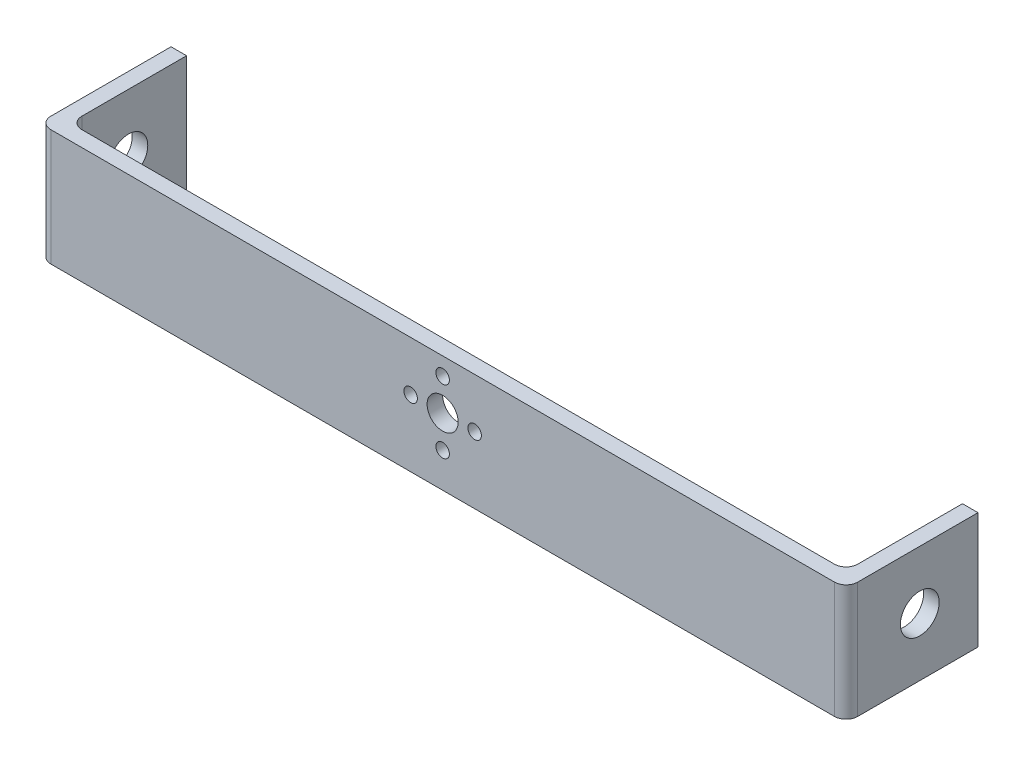
ISO-10303-21;
HEADER;
FILE_DESCRIPTION(('STEP AP214'),'2;1');
FILE_NAME('part.step','',(''),(''),'','','');
FILE_SCHEMA(('AUTOMOTIVE_DESIGN { 1 0 10303 214 1 1 1 1 }'));
ENDSEC;
DATA;
#1=APPLICATION_CONTEXT('core data for automotive mechanical design processes');
#2=APPLICATION_PROTOCOL_DEFINITION('international standard','automotive_design',2000,#1);
#3=PRODUCT_CONTEXT('',#1,'mechanical');
#4=PRODUCT('Part','Part','',(#3));
#5=PRODUCT_RELATED_PRODUCT_CATEGORY('part','',(#4));
#6=PRODUCT_DEFINITION_FORMATION('','',#4);
#7=PRODUCT_DEFINITION_CONTEXT('part definition',#1,'design');
#8=PRODUCT_DEFINITION('design','',#6,#7);
#9=PRODUCT_DEFINITION_SHAPE('','',#8);
#10=(LENGTH_UNIT() NAMED_UNIT(*) SI_UNIT(.MILLI.,.METRE.));
#11=(NAMED_UNIT(*) PLANE_ANGLE_UNIT() SI_UNIT($,.RADIAN.));
#12=(NAMED_UNIT(*) SI_UNIT($,.STERADIAN.) SOLID_ANGLE_UNIT());
#13=UNCERTAINTY_MEASURE_WITH_UNIT(LENGTH_MEASURE(1.E-05),#10,'distance_accuracy_value','');
#14=(GEOMETRIC_REPRESENTATION_CONTEXT(3) GLOBAL_UNCERTAINTY_ASSIGNED_CONTEXT((#13)) GLOBAL_UNIT_ASSIGNED_CONTEXT((#10,
#11,#12)) REPRESENTATION_CONTEXT('',''));
#15=CARTESIAN_POINT('',(0.,0.,0.));
#16=DIRECTION('',(0.,0.,1.));
#17=DIRECTION('',(1.,0.,0.));
#18=AXIS2_PLACEMENT_3D('',#15,#16,#17);
#19=CARTESIAN_POINT('',(100.,0.,0.));
#20=DIRECTION('',(0.,-1.,0.));
#21=DIRECTION('',(0.,0.,-1.));
#22=AXIS2_PLACEMENT_3D('',#19,#20,#21);
#23=PLANE('',#22);
#24=DIRECTION('',(1.,0.,0.));
#25=VECTOR('',#24,1.);
#26=CARTESIAN_POINT('',(-100.,0.,4.));
#27=LINE('',#26,#25);
#28=CARTESIAN_POINT('',(-101.,0.,4.));
#29=VERTEX_POINT('',#28);
#30=CARTESIAN_POINT('',(101.,0.,4.));
#31=VERTEX_POINT('',#30);
#32=EDGE_CURVE('E149',#29,#31,#27,.T.);
#33=ORIENTED_EDGE('',*,*,#32,.F.);
#34=CARTESIAN_POINT('',(-101.,0.,1.));
#35=DIRECTION('',(0.,-1.,0.));
#36=DIRECTION('',(0.,0.,-1.));
#37=AXIS2_PLACEMENT_3D('',#34,#35,#36);
#38=CIRCLE('',#37,3.);
#39=CARTESIAN_POINT('',(-104.,0.,1.));
#40=VERTEX_POINT('',#39);
#41=EDGE_CURVE('E199',#29,#40,#38,.T.);
#42=ORIENTED_EDGE('',*,*,#41,.T.);
#43=DIRECTION('',(0.,0.,1.));
#44=VECTOR('',#43,1.);
#45=CARTESIAN_POINT('',(-104.,0.,0.));
#46=LINE('',#45,#44);
#47=CARTESIAN_POINT('',(-104.,0.,-30.));
#48=VERTEX_POINT('',#47);
#49=EDGE_CURVE('E156',#48,#40,#46,.T.);
#50=ORIENTED_EDGE('',*,*,#49,.F.);
#51=DIRECTION('',(-1.,0.,0.));
#52=VECTOR('',#51,1.);
#53=CARTESIAN_POINT('',(-100.,0.,-30.));
#54=LINE('',#53,#52);
#55=CARTESIAN_POINT('',(-100.,0.,-30.));
#56=VERTEX_POINT('',#55);
#57=EDGE_CURVE('E183',#56,#48,#54,.T.);
#58=ORIENTED_EDGE('',*,*,#57,.F.);
#59=DIRECTION('',(0.,0.,1.));
#60=VECTOR('',#59,1.);
#61=CARTESIAN_POINT('',(-100.,0.,0.));
#62=LINE('',#61,#60);
#63=CARTESIAN_POINT('',(-100.,0.,-3.));
#64=VERTEX_POINT('',#63);
#65=EDGE_CURVE('E132',#56,#64,#62,.T.);
#66=ORIENTED_EDGE('',*,*,#65,.T.);
#67=CARTESIAN_POINT('',(-97.,0.,-3.));
#68=DIRECTION('',(0.,-1.,0.));
#69=DIRECTION('',(0.,0.,-1.));
#70=AXIS2_PLACEMENT_3D('',#67,#68,#69);
#71=CIRCLE('',#70,3.);
#72=CARTESIAN_POINT('',(-97.,0.,0.));
#73=VERTEX_POINT('',#72);
#74=EDGE_CURVE('E215',#64,#73,#71,.F.);
#75=ORIENTED_EDGE('',*,*,#74,.T.);
#76=DIRECTION('',(1.,0.,0.));
#77=VECTOR('',#76,1.);
#78=CARTESIAN_POINT('',(-100.,0.,0.));
#79=LINE('',#78,#77);
#80=CARTESIAN_POINT('',(97.,0.,0.));
#81=VERTEX_POINT('',#80);
#82=EDGE_CURVE('E162',#73,#81,#79,.T.);
#83=ORIENTED_EDGE('',*,*,#82,.T.);
#84=CARTESIAN_POINT('',(97.,0.,-3.));
#85=DIRECTION('',(0.,-1.,0.));
#86=DIRECTION('',(0.,0.,-1.));
#87=AXIS2_PLACEMENT_3D('',#84,#85,#86);
#88=CIRCLE('',#87,3.);
#89=CARTESIAN_POINT('',(100.,0.,-3.));
#90=VERTEX_POINT('',#89);
#91=EDGE_CURVE('E11',#81,#90,#88,.F.);
#92=ORIENTED_EDGE('',*,*,#91,.T.);
#93=DIRECTION('',(0.,0.,-1.));
#94=VECTOR('',#93,1.);
#95=CARTESIAN_POINT('',(100.,0.,0.));
#96=LINE('',#95,#94);
#97=CARTESIAN_POINT('',(100.,0.,-30.));
#98=VERTEX_POINT('',#97);
#99=EDGE_CURVE('E167',#90,#98,#96,.T.);
#100=ORIENTED_EDGE('',*,*,#99,.T.);
#101=DIRECTION('',(1.,0.,0.));
#102=VECTOR('',#101,1.);
#103=CARTESIAN_POINT('',(100.,0.,-30.));
#104=LINE('',#103,#102);
#105=CARTESIAN_POINT('',(104.,0.,-30.));
#106=VERTEX_POINT('',#105);
#107=EDGE_CURVE('E141',#98,#106,#104,.T.);
#108=ORIENTED_EDGE('',*,*,#107,.T.);
#109=DIRECTION('',(0.,0.,-1.));
#110=VECTOR('',#109,1.);
#111=CARTESIAN_POINT('',(104.,0.,0.));
#112=LINE('',#111,#110);
#113=CARTESIAN_POINT('',(104.,0.,1.));
#114=VERTEX_POINT('',#113);
#115=EDGE_CURVE('E131',#114,#106,#112,.T.);
#116=ORIENTED_EDGE('',*,*,#115,.F.);
#117=CARTESIAN_POINT('',(101.,0.,1.));
#118=DIRECTION('',(0.,-1.,0.));
#119=DIRECTION('',(0.,0.,-1.));
#120=AXIS2_PLACEMENT_3D('',#117,#118,#119);
#121=CIRCLE('',#120,3.);
#122=EDGE_CURVE('E197',#114,#31,#121,.T.);
#123=ORIENTED_EDGE('',*,*,#122,.T.);
#124=EDGE_LOOP('',(#33,#42,#50,#58,#66,#75,#83,#92,#100,#108,#116,#123));
#125=FACE_BOUND('',#124,.T.);
#126=ADVANCED_FACE('F34',(#125),#23,.T.);
#127=CARTESIAN_POINT('',(100.,0.,-30.));
#128=DIRECTION('',(0.,0.,-1.));
#129=DIRECTION('',(0.,1.,0.));
#130=AXIS2_PLACEMENT_3D('',#127,#128,#129);
#131=PLANE('',#130);
#132=ORIENTED_EDGE('',*,*,#107,.F.);
#133=DIRECTION('',(0.,1.,0.));
#134=VECTOR('',#133,1.);
#135=CARTESIAN_POINT('',(100.,0.,-30.));
#136=LINE('',#135,#134);
#137=CARTESIAN_POINT('',(100.,30.,-30.));
#138=VERTEX_POINT('',#137);
#139=EDGE_CURVE('E140',#98,#138,#136,.T.);
#140=ORIENTED_EDGE('',*,*,#139,.T.);
#141=DIRECTION('',(1.,0.,0.));
#142=VECTOR('',#141,1.);
#143=CARTESIAN_POINT('',(100.,30.,-30.));
#144=LINE('',#143,#142);
#145=CARTESIAN_POINT('',(104.,30.,-30.));
#146=VERTEX_POINT('',#145);
#147=EDGE_CURVE('E126',#138,#146,#144,.T.);
#148=ORIENTED_EDGE('',*,*,#147,.T.);
#149=DIRECTION('',(0.,1.,0.));
#150=VECTOR('',#149,1.);
#151=CARTESIAN_POINT('',(104.,0.,-30.));
#152=LINE('',#151,#150);
#153=EDGE_CURVE('E138',#106,#146,#152,.T.);
#154=ORIENTED_EDGE('',*,*,#153,.F.);
#155=EDGE_LOOP('',(#132,#140,#148,#154));
#156=FACE_BOUND('',#155,.T.);
#157=ADVANCED_FACE('F137',(#156),#131,.T.);
#158=CARTESIAN_POINT('',(-100.,30.,0.));
#159=DIRECTION('',(0.,-1.,0.));
#160=DIRECTION('',(0.,0.,1.));
#161=AXIS2_PLACEMENT_3D('',#158,#159,#160);
#162=PLANE('',#161);
#163=DIRECTION('',(0.,0.,1.));
#164=VECTOR('',#163,1.);
#165=CARTESIAN_POINT('',(-104.,30.,0.));
#166=LINE('',#165,#164);
#167=CARTESIAN_POINT('',(-104.,30.,-30.));
#168=VERTEX_POINT('',#167);
#169=CARTESIAN_POINT('',(-104.,30.,1.));
#170=VERTEX_POINT('',#169);
#171=EDGE_CURVE('E155',#168,#170,#166,.T.);
#172=ORIENTED_EDGE('',*,*,#171,.T.);
#173=CARTESIAN_POINT('',(-101.,30.,1.));
#174=DIRECTION('',(0.,-1.,0.));
#175=DIRECTION('',(0.,0.,-1.));
#176=AXIS2_PLACEMENT_3D('',#173,#174,#175);
#177=CIRCLE('',#176,3.);
#178=CARTESIAN_POINT('',(-101.,30.,4.));
#179=VERTEX_POINT('',#178);
#180=EDGE_CURVE('E189',#170,#179,#177,.F.);
#181=ORIENTED_EDGE('',*,*,#180,.T.);
#182=DIRECTION('',(1.,0.,0.));
#183=VECTOR('',#182,1.);
#184=CARTESIAN_POINT('',(-100.,30.,4.));
#185=LINE('',#184,#183);
#186=CARTESIAN_POINT('',(101.,30.,4.));
#187=VERTEX_POINT('',#186);
#188=EDGE_CURVE('E147',#179,#187,#185,.T.);
#189=ORIENTED_EDGE('',*,*,#188,.T.);
#190=CARTESIAN_POINT('',(101.,30.,1.));
#191=DIRECTION('',(0.,-1.,0.));
#192=DIRECTION('',(0.,0.,-1.));
#193=AXIS2_PLACEMENT_3D('',#190,#191,#192);
#194=CIRCLE('',#193,3.);
#195=CARTESIAN_POINT('',(104.,30.,1.));
#196=VERTEX_POINT('',#195);
#197=EDGE_CURVE('E50',#187,#196,#194,.F.);
#198=ORIENTED_EDGE('',*,*,#197,.T.);
#199=DIRECTION('',(0.,0.,-1.));
#200=VECTOR('',#199,1.);
#201=CARTESIAN_POINT('',(104.,30.,0.));
#202=LINE('',#201,#200);
#203=EDGE_CURVE('E121',#196,#146,#202,.T.);
#204=ORIENTED_EDGE('',*,*,#203,.T.);
#205=ORIENTED_EDGE('',*,*,#147,.F.);
#206=DIRECTION('',(0.,0.,-1.));
#207=VECTOR('',#206,1.);
#208=CARTESIAN_POINT('',(100.,30.,0.));
#209=LINE('',#208,#207);
#210=CARTESIAN_POINT('',(100.,30.,-3.));
#211=VERTEX_POINT('',#210);
#212=EDGE_CURVE('E169',#211,#138,#209,.T.);
#213=ORIENTED_EDGE('',*,*,#212,.F.);
#214=CARTESIAN_POINT('',(97.,30.,-3.));
#215=DIRECTION('',(0.,-1.,0.));
#216=DIRECTION('',(0.,0.,-1.));
#217=AXIS2_PLACEMENT_3D('',#214,#215,#216);
#218=CIRCLE('',#217,3.);
#219=CARTESIAN_POINT('',(97.,30.,0.));
#220=VERTEX_POINT('',#219);
#221=EDGE_CURVE('E43',#211,#220,#218,.T.);
#222=ORIENTED_EDGE('',*,*,#221,.T.);
#223=DIRECTION('',(1.,0.,0.));
#224=VECTOR('',#223,1.);
#225=CARTESIAN_POINT('',(-100.,30.,0.));
#226=LINE('',#225,#224);
#227=CARTESIAN_POINT('',(-97.,30.,0.));
#228=VERTEX_POINT('',#227);
#229=EDGE_CURVE('E166',#228,#220,#226,.T.);
#230=ORIENTED_EDGE('',*,*,#229,.F.);
#231=CARTESIAN_POINT('',(-97.,30.,-3.));
#232=DIRECTION('',(0.,-1.,0.));
#233=DIRECTION('',(0.,0.,-1.));
#234=AXIS2_PLACEMENT_3D('',#231,#232,#233);
#235=CIRCLE('',#234,3.);
#236=CARTESIAN_POINT('',(-100.,30.,-3.));
#237=VERTEX_POINT('',#236);
#238=EDGE_CURVE('E213',#228,#237,#235,.T.);
#239=ORIENTED_EDGE('',*,*,#238,.T.);
#240=DIRECTION('',(0.,0.,1.));
#241=VECTOR('',#240,1.);
#242=CARTESIAN_POINT('',(-100.,30.,0.));
#243=LINE('',#242,#241);
#244=CARTESIAN_POINT('',(-100.,30.,-30.));
#245=VERTEX_POINT('',#244);
#246=EDGE_CURVE('E165',#245,#237,#243,.T.);
#247=ORIENTED_EDGE('',*,*,#246,.F.);
#248=DIRECTION('',(-1.,0.,0.));
#249=VECTOR('',#248,1.);
#250=CARTESIAN_POINT('',(-100.,30.,-30.));
#251=LINE('',#250,#249);
#252=EDGE_CURVE('E142',#245,#168,#251,.T.);
#253=ORIENTED_EDGE('',*,*,#252,.T.);
#254=EDGE_LOOP('',(#172,#181,#189,#198,#204,#205,#213,#222,#230,#239,#247,#253));
#255=FACE_BOUND('',#254,.T.);
#256=ADVANCED_FACE('F124',(#255),#162,.F.);
#257=CARTESIAN_POINT('',(-100.,0.,-30.));
#258=DIRECTION('',(0.,0.,1.));
#259=DIRECTION('',(0.,1.,0.));
#260=AXIS2_PLACEMENT_3D('',#257,#258,#259);
#261=PLANE('',#260);
#262=DIRECTION('',(0.,1.,0.));
#263=VECTOR('',#262,1.);
#264=CARTESIAN_POINT('',(-100.,0.,-30.));
#265=LINE('',#264,#263);
#266=EDGE_CURVE('E172',#56,#245,#265,.T.);
#267=ORIENTED_EDGE('',*,*,#266,.F.);
#268=ORIENTED_EDGE('',*,*,#57,.T.);
#269=DIRECTION('',(0.,1.,0.));
#270=VECTOR('',#269,1.);
#271=CARTESIAN_POINT('',(-104.,0.,-30.));
#272=LINE('',#271,#270);
#273=EDGE_CURVE('E159',#48,#168,#272,.T.);
#274=ORIENTED_EDGE('',*,*,#273,.T.);
#275=ORIENTED_EDGE('',*,*,#252,.F.);
#276=EDGE_LOOP('',(#267,#268,#274,#275));
#277=FACE_BOUND('',#276,.T.);
#278=ADVANCED_FACE('F254',(#277),#261,.F.);
#279=CARTESIAN_POINT('',(-104.,0.,0.));
#280=DIRECTION('',(-1.,0.,0.));
#281=DIRECTION('',(0.,0.,1.));
#282=AXIS2_PLACEMENT_3D('',#279,#280,#281);
#283=PLANE('',#282);
#284=CARTESIAN_POINT('',(-104.,15.,-14.9968314858325));
#285=DIRECTION('',(1.,0.,0.));
#286=DIRECTION('',(0.,0.,-1.));
#287=AXIS2_PLACEMENT_3D('',#284,#285,#286);
#288=CIRCLE('',#287,5.);
#289=CARTESIAN_POINT('',(-104.,15.,-19.9968314858325));
#290=VERTEX_POINT('',#289);
#291=EDGE_CURVE('E465',#290,#290,#288,.T.);
#292=ORIENTED_EDGE('',*,*,#291,.T.);
#293=EDGE_LOOP('',(#292));
#294=FACE_BOUND('',#293,.T.);
#295=ORIENTED_EDGE('',*,*,#49,.T.);
#296=DIRECTION('',(0.,1.,0.));
#297=VECTOR('',#296,1.);
#298=CARTESIAN_POINT('',(-104.,0.,1.));
#299=LINE('',#298,#297);
#300=EDGE_CURVE('E185',#40,#170,#299,.T.);
#301=ORIENTED_EDGE('',*,*,#300,.T.);
#302=ORIENTED_EDGE('',*,*,#171,.F.);
#303=ORIENTED_EDGE('',*,*,#273,.F.);
#304=EDGE_LOOP('',(#295,#301,#302,#303));
#305=FACE_BOUND('',#304,.T.);
#306=ADVANCED_FACE('F256',(#294,#305),#283,.T.);
#307=CARTESIAN_POINT('',(-100.,0.,4.));
#308=DIRECTION('',(0.,0.,1.));
#309=DIRECTION('',(1.,0.,0.));
#310=AXIS2_PLACEMENT_3D('',#307,#308,#309);
#311=PLANE('',#310);
#312=ORIENTED_EDGE('',*,*,#188,.F.);
#313=DIRECTION('',(0.,1.,0.));
#314=VECTOR('',#313,1.);
#315=CARTESIAN_POINT('',(-101.,0.,4.));
#316=LINE('',#315,#314);
#317=EDGE_CURVE('E195',#179,#29,#316,.F.);
#318=ORIENTED_EDGE('',*,*,#317,.T.);
#319=ORIENTED_EDGE('',*,*,#32,.T.);
#320=DIRECTION('',(0.,1.,0.));
#321=VECTOR('',#320,1.);
#322=CARTESIAN_POINT('',(101.,0.,4.));
#323=LINE('',#322,#321);
#324=EDGE_CURVE('E192',#31,#187,#323,.T.);
#325=ORIENTED_EDGE('',*,*,#324,.T.);
#326=EDGE_LOOP('',(#312,#318,#319,#325));
#327=FACE_BOUND('',#326,.T.);
#328=CARTESIAN_POINT('',(8.25,17.2,4.));
#329=DIRECTION('',(0.,0.,1.));
#330=DIRECTION('',(1.,0.,0.));
#331=AXIS2_PLACEMENT_3D('',#328,#329,#330);
#332=CIRCLE('',#331,1.75);
#333=CARTESIAN_POINT('',(10.,17.2,4.));
#334=VERTEX_POINT('',#333);
#335=EDGE_CURVE('E490',#334,#334,#332,.T.);
#336=ORIENTED_EDGE('',*,*,#335,.F.);
#337=EDGE_LOOP('',(#336));
#338=FACE_BOUND('',#337,.T.);
#339=CARTESIAN_POINT('',(0.,8.95,4.));
#340=DIRECTION('',(0.,0.,1.));
#341=DIRECTION('',(1.,0.,0.));
#342=AXIS2_PLACEMENT_3D('',#339,#340,#341);
#343=CIRCLE('',#342,1.75);
#344=CARTESIAN_POINT('',(1.75,8.95,4.));
#345=VERTEX_POINT('',#344);
#346=EDGE_CURVE('E493',#345,#345,#343,.T.);
#347=ORIENTED_EDGE('',*,*,#346,.F.);
#348=EDGE_LOOP('',(#347));
#349=FACE_BOUND('',#348,.T.);
#350=CARTESIAN_POINT('',(-8.25,17.2000000000001,4.));
#351=DIRECTION('',(0.,0.,1.));
#352=DIRECTION('',(1.,0.,0.));
#353=AXIS2_PLACEMENT_3D('',#350,#351,#352);
#354=CIRCLE('',#353,1.75);
#355=CARTESIAN_POINT('',(-6.5,17.2000000000001,4.));
#356=VERTEX_POINT('',#355);
#357=EDGE_CURVE('E496',#356,#356,#354,.T.);
#358=ORIENTED_EDGE('',*,*,#357,.F.);
#359=EDGE_LOOP('',(#358));
#360=FACE_BOUND('',#359,.T.);
#361=CARTESIAN_POINT('',(0.,25.45,4.));
#362=DIRECTION('',(0.,0.,1.));
#363=DIRECTION('',(1.,0.,0.));
#364=AXIS2_PLACEMENT_3D('',#361,#362,#363);
#365=CIRCLE('',#364,1.75);
#366=CARTESIAN_POINT('',(1.75,25.45,4.));
#367=VERTEX_POINT('',#366);
#368=EDGE_CURVE('E484',#367,#367,#365,.T.);
#369=ORIENTED_EDGE('',*,*,#368,.F.);
#370=EDGE_LOOP('',(#369));
#371=FACE_BOUND('',#370,.T.);
#372=CARTESIAN_POINT('',(0.,17.2,4.));
#373=DIRECTION('',(0.,0.,1.));
#374=DIRECTION('',(1.,0.,0.));
#375=AXIS2_PLACEMENT_3D('',#372,#373,#374);
#376=CIRCLE('',#375,4.);
#377=CARTESIAN_POINT('',(4.,17.2,4.));
#378=VERTEX_POINT('',#377);
#379=EDGE_CURVE('E466',#378,#378,#376,.T.);
#380=ORIENTED_EDGE('',*,*,#379,.F.);
#381=EDGE_LOOP('',(#380));
#382=FACE_BOUND('',#381,.T.);
#383=ADVANCED_FACE('F277',(#327,#338,#349,#360,#371,#382),#311,.T.);
#384=CARTESIAN_POINT('',(104.,0.,0.));
#385=DIRECTION('',(1.,0.,0.));
#386=DIRECTION('',(0.,0.,-1.));
#387=AXIS2_PLACEMENT_3D('',#384,#385,#386);
#388=PLANE('',#387);
#389=CARTESIAN_POINT('',(104.,15.,-14.9968314858325));
#390=DIRECTION('',(1.,0.,0.));
#391=DIRECTION('',(0.,0.,-1.));
#392=AXIS2_PLACEMENT_3D('',#389,#390,#391);
#393=CIRCLE('',#392,5.);
#394=CARTESIAN_POINT('',(104.,15.,-19.9968314858325));
#395=VERTEX_POINT('',#394);
#396=EDGE_CURVE('E176',#395,#395,#393,.T.);
#397=ORIENTED_EDGE('',*,*,#396,.F.);
#398=EDGE_LOOP('',(#397));
#399=FACE_BOUND('',#398,.T.);
#400=ORIENTED_EDGE('',*,*,#203,.F.);
#401=DIRECTION('',(0.,1.,0.));
#402=VECTOR('',#401,1.);
#403=CARTESIAN_POINT('',(104.,0.,1.));
#404=LINE('',#403,#402);
#405=EDGE_CURVE('E211',#196,#114,#404,.F.);
#406=ORIENTED_EDGE('',*,*,#405,.T.);
#407=ORIENTED_EDGE('',*,*,#115,.T.);
#408=ORIENTED_EDGE('',*,*,#153,.T.);
#409=EDGE_LOOP('',(#400,#406,#407,#408));
#410=FACE_BOUND('',#409,.T.);
#411=ADVANCED_FACE('F144',(#399,#410),#388,.T.);
#412=CARTESIAN_POINT('',(-100.,0.,0.));
#413=DIRECTION('',(-1.,0.,0.));
#414=DIRECTION('',(0.,0.,1.));
#415=AXIS2_PLACEMENT_3D('',#412,#413,#414);
#416=PLANE('',#415);
#417=CARTESIAN_POINT('',(-100.,15.,-14.9968314858325));
#418=DIRECTION('',(-1.,0.,0.));
#419=DIRECTION('',(0.,0.,1.));
#420=AXIS2_PLACEMENT_3D('',#417,#418,#419);
#421=CIRCLE('',#420,5.);
#422=CARTESIAN_POINT('',(-100.,15.,-9.99683148583255));
#423=VERTEX_POINT('',#422);
#424=EDGE_CURVE('E468',#423,#423,#421,.T.);
#425=ORIENTED_EDGE('',*,*,#424,.T.);
#426=EDGE_LOOP('',(#425));
#427=FACE_BOUND('',#426,.T.);
#428=ORIENTED_EDGE('',*,*,#246,.T.);
#429=DIRECTION('',(0.,1.,0.));
#430=VECTOR('',#429,1.);
#431=CARTESIAN_POINT('',(-100.,0.,-3.));
#432=LINE('',#431,#430);
#433=EDGE_CURVE('E206',#237,#64,#432,.F.);
#434=ORIENTED_EDGE('',*,*,#433,.T.);
#435=ORIENTED_EDGE('',*,*,#65,.F.);
#436=ORIENTED_EDGE('',*,*,#266,.T.);
#437=EDGE_LOOP('',(#428,#434,#435,#436));
#438=FACE_BOUND('',#437,.T.);
#439=ADVANCED_FACE('F241',(#427,#438),#416,.F.);
#440=CARTESIAN_POINT('',(-100.,0.,0.));
#441=DIRECTION('',(0.,0.,1.));
#442=DIRECTION('',(1.,0.,0.));
#443=AXIS2_PLACEMENT_3D('',#440,#441,#442);
#444=PLANE('',#443);
#445=CARTESIAN_POINT('',(8.25,17.2,0.));
#446=DIRECTION('',(0.,0.,-1.));
#447=DIRECTION('',(0.,1.,0.));
#448=AXIS2_PLACEMENT_3D('',#445,#446,#447);
#449=CIRCLE('',#448,1.75);
#450=CARTESIAN_POINT('',(8.25000000000001,18.95,0.));
#451=VERTEX_POINT('',#450);
#452=EDGE_CURVE('E499',#451,#451,#449,.T.);
#453=ORIENTED_EDGE('',*,*,#452,.F.);
#454=EDGE_LOOP('',(#453));
#455=FACE_BOUND('',#454,.T.);
#456=CARTESIAN_POINT('',(0.,8.95,0.));
#457=DIRECTION('',(0.,0.,-1.));
#458=DIRECTION('',(1.,0.,0.));
#459=AXIS2_PLACEMENT_3D('',#456,#457,#458);
#460=CIRCLE('',#459,1.75);
#461=CARTESIAN_POINT('',(1.75,8.95,0.));
#462=VERTEX_POINT('',#461);
#463=EDGE_CURVE('E503',#462,#462,#460,.T.);
#464=ORIENTED_EDGE('',*,*,#463,.F.);
#465=EDGE_LOOP('',(#464));
#466=FACE_BOUND('',#465,.T.);
#467=CARTESIAN_POINT('',(-8.25,17.2000000000001,0.));
#468=DIRECTION('',(0.,0.,-1.));
#469=DIRECTION('',(0.,-1.,0.));
#470=AXIS2_PLACEMENT_3D('',#467,#468,#469);
#471=CIRCLE('',#470,1.75);
#472=CARTESIAN_POINT('',(-8.25000000000002,15.4500000000001,0.));
#473=VERTEX_POINT('',#472);
#474=EDGE_CURVE('E500',#473,#473,#471,.T.);
#475=ORIENTED_EDGE('',*,*,#474,.F.);
#476=EDGE_LOOP('',(#475));
#477=FACE_BOUND('',#476,.T.);
#478=CARTESIAN_POINT('',(0.,25.45,0.));
#479=DIRECTION('',(0.,0.,-1.));
#480=DIRECTION('',(-1.,0.,0.));
#481=AXIS2_PLACEMENT_3D('',#478,#479,#480);
#482=CIRCLE('',#481,1.75);
#483=CARTESIAN_POINT('',(-1.75,25.45,0.));
#484=VERTEX_POINT('',#483);
#485=EDGE_CURVE('E487',#484,#484,#482,.T.);
#486=ORIENTED_EDGE('',*,*,#485,.F.);
#487=EDGE_LOOP('',(#486));
#488=FACE_BOUND('',#487,.T.);
#489=CARTESIAN_POINT('',(0.,17.2,0.));
#490=DIRECTION('',(0.,0.,-1.));
#491=DIRECTION('',(-1.,0.,0.));
#492=AXIS2_PLACEMENT_3D('',#489,#490,#491);
#493=CIRCLE('',#492,4.);
#494=CARTESIAN_POINT('',(-4.,17.2,0.));
#495=VERTEX_POINT('',#494);
#496=EDGE_CURVE('E470',#495,#495,#493,.T.);
#497=ORIENTED_EDGE('',*,*,#496,.F.);
#498=EDGE_LOOP('',(#497));
#499=FACE_BOUND('',#498,.T.);
#500=DIRECTION('',(0.,1.,0.));
#501=VECTOR('',#500,1.);
#502=CARTESIAN_POINT('',(-97.,30.,0.));
#503=LINE('',#502,#501);
#504=EDGE_CURVE('E203',#73,#228,#503,.T.);
#505=ORIENTED_EDGE('',*,*,#504,.T.);
#506=ORIENTED_EDGE('',*,*,#229,.T.);
#507=DIRECTION('',(0.,1.,0.));
#508=VECTOR('',#507,1.);
#509=CARTESIAN_POINT('',(97.,0.,0.));
#510=LINE('',#509,#508);
#511=EDGE_CURVE('E201',#220,#81,#510,.F.);
#512=ORIENTED_EDGE('',*,*,#511,.T.);
#513=ORIENTED_EDGE('',*,*,#82,.F.);
#514=EDGE_LOOP('',(#505,#506,#512,#513));
#515=FACE_BOUND('',#514,.T.);
#516=ADVANCED_FACE('F219',(#455,#466,#477,#488,#499,#515),#444,.F.);
#517=CARTESIAN_POINT('',(100.,0.,0.));
#518=DIRECTION('',(1.,0.,0.));
#519=DIRECTION('',(0.,0.,-1.));
#520=AXIS2_PLACEMENT_3D('',#517,#518,#519);
#521=PLANE('',#520);
#522=CARTESIAN_POINT('',(100.,15.,-14.9968314858325));
#523=DIRECTION('',(1.,0.,0.));
#524=DIRECTION('',(0.,0.,-1.));
#525=AXIS2_PLACEMENT_3D('',#522,#523,#524);
#526=CIRCLE('',#525,5.);
#527=CARTESIAN_POINT('',(100.,15.,-19.9968314858325));
#528=VERTEX_POINT('',#527);
#529=EDGE_CURVE('E38',#528,#528,#526,.T.);
#530=ORIENTED_EDGE('',*,*,#529,.T.);
#531=EDGE_LOOP('',(#530));
#532=FACE_BOUND('',#531,.T.);
#533=ORIENTED_EDGE('',*,*,#99,.F.);
#534=DIRECTION('',(0.,1.,0.));
#535=VECTOR('',#534,1.);
#536=CARTESIAN_POINT('',(100.,30.,-3.));
#537=LINE('',#536,#535);
#538=EDGE_CURVE('E208',#90,#211,#537,.T.);
#539=ORIENTED_EDGE('',*,*,#538,.T.);
#540=ORIENTED_EDGE('',*,*,#212,.T.);
#541=ORIENTED_EDGE('',*,*,#139,.F.);
#542=EDGE_LOOP('',(#533,#539,#540,#541));
#543=FACE_BOUND('',#542,.T.);
#544=ADVANCED_FACE('F228',(#532,#543),#521,.F.);
#545=CARTESIAN_POINT('',(-101.,0.,1.));
#546=DIRECTION('',(0.,1.,0.));
#547=DIRECTION('',(0.,0.,1.));
#548=AXIS2_PLACEMENT_3D('',#545,#546,#547);
#549=CYLINDRICAL_SURFACE('',#548,3.);
#550=ORIENTED_EDGE('',*,*,#41,.F.);
#551=ORIENTED_EDGE('',*,*,#317,.F.);
#552=ORIENTED_EDGE('',*,*,#180,.F.);
#553=ORIENTED_EDGE('',*,*,#300,.F.);
#554=EDGE_LOOP('',(#550,#551,#552,#553));
#555=FACE_BOUND('',#554,.T.);
#556=ADVANCED_FACE('F230',(#555),#549,.T.);
#557=CARTESIAN_POINT('',(-97.,0.,-3.));
#558=DIRECTION('',(0.,-1.,0.));
#559=DIRECTION('',(0.,0.,-1.));
#560=AXIS2_PLACEMENT_3D('',#557,#558,#559);
#561=CYLINDRICAL_SURFACE('',#560,3.);
#562=ORIENTED_EDGE('',*,*,#74,.F.);
#563=ORIENTED_EDGE('',*,*,#433,.F.);
#564=ORIENTED_EDGE('',*,*,#238,.F.);
#565=ORIENTED_EDGE('',*,*,#504,.F.);
#566=EDGE_LOOP('',(#562,#563,#564,#565));
#567=FACE_BOUND('',#566,.T.);
#568=ADVANCED_FACE('F237',(#567),#561,.F.);
#569=CARTESIAN_POINT('',(97.,0.,-3.));
#570=DIRECTION('',(0.,-1.,0.));
#571=DIRECTION('',(0.,0.,-1.));
#572=AXIS2_PLACEMENT_3D('',#569,#570,#571);
#573=CYLINDRICAL_SURFACE('',#572,3.);
#574=ORIENTED_EDGE('',*,*,#91,.F.);
#575=ORIENTED_EDGE('',*,*,#511,.F.);
#576=ORIENTED_EDGE('',*,*,#221,.F.);
#577=ORIENTED_EDGE('',*,*,#538,.F.);
#578=EDGE_LOOP('',(#574,#575,#576,#577));
#579=FACE_BOUND('',#578,.T.);
#580=ADVANCED_FACE('F223',(#579),#573,.F.);
#581=CARTESIAN_POINT('',(101.,0.,1.));
#582=DIRECTION('',(0.,1.,0.));
#583=DIRECTION('',(0.,0.,1.));
#584=AXIS2_PLACEMENT_3D('',#581,#582,#583);
#585=CYLINDRICAL_SURFACE('',#584,3.);
#586=ORIENTED_EDGE('',*,*,#122,.F.);
#587=ORIENTED_EDGE('',*,*,#405,.F.);
#588=ORIENTED_EDGE('',*,*,#197,.F.);
#589=ORIENTED_EDGE('',*,*,#324,.F.);
#590=EDGE_LOOP('',(#586,#587,#588,#589));
#591=FACE_BOUND('',#590,.T.);
#592=ADVANCED_FACE('F36',(#591),#585,.T.);
#593=CARTESIAN_POINT('',(-104.,15.,-14.9968314858325));
#594=DIRECTION('',(1.,0.,0.));
#595=DIRECTION('',(0.,0.,-1.));
#596=AXIS2_PLACEMENT_3D('',#593,#594,#595);
#597=CYLINDRICAL_SURFACE('',#596,5.);
#598=ORIENTED_EDGE('',*,*,#396,.T.);
#599=EDGE_LOOP('',(#598));
#600=FACE_BOUND('',#599,.T.);
#601=ORIENTED_EDGE('',*,*,#529,.F.);
#602=EDGE_LOOP('',(#601));
#603=FACE_BOUND('',#602,.T.);
#604=ADVANCED_FACE('F265',(#600,#603),#597,.F.);
#605=ORIENTED_EDGE('',*,*,#291,.F.);
#606=EDGE_LOOP('',(#605));
#607=FACE_BOUND('',#606,.T.);
#608=ORIENTED_EDGE('',*,*,#424,.F.);
#609=EDGE_LOOP('',(#608));
#610=FACE_BOUND('',#609,.T.);
#611=ADVANCED_FACE('F270',(#607,#610),#597,.F.);
#612=CARTESIAN_POINT('',(0.,17.2,10.));
#613=DIRECTION('',(0.,0.,-1.));
#614=DIRECTION('',(-1.,0.,0.));
#615=AXIS2_PLACEMENT_3D('',#612,#613,#614);
#616=CYLINDRICAL_SURFACE('',#615,4.);
#617=ORIENTED_EDGE('',*,*,#379,.T.);
#618=EDGE_LOOP('',(#617));
#619=FACE_BOUND('',#618,.T.);
#620=ORIENTED_EDGE('',*,*,#496,.T.);
#621=EDGE_LOOP('',(#620));
#622=FACE_BOUND('',#621,.T.);
#623=ADVANCED_FACE('F334',(#619,#622),#616,.F.);
#624=CARTESIAN_POINT('',(0.,25.45,10.));
#625=DIRECTION('',(0.,0.,-1.));
#626=DIRECTION('',(-1.,0.,0.));
#627=AXIS2_PLACEMENT_3D('',#624,#625,#626);
#628=CYLINDRICAL_SURFACE('',#627,1.75);
#629=ORIENTED_EDGE('',*,*,#368,.T.);
#630=EDGE_LOOP('',(#629));
#631=FACE_BOUND('',#630,.T.);
#632=ORIENTED_EDGE('',*,*,#485,.T.);
#633=EDGE_LOOP('',(#632));
#634=FACE_BOUND('',#633,.T.);
#635=ADVANCED_FACE('F326',(#631,#634),#628,.F.);
#636=CARTESIAN_POINT('',(-8.25,17.2000000000001,10.));
#637=DIRECTION('',(0.,0.,-1.));
#638=DIRECTION('',(-1.,0.,0.));
#639=AXIS2_PLACEMENT_3D('',#636,#637,#638);
#640=CYLINDRICAL_SURFACE('',#639,1.75);
#641=ORIENTED_EDGE('',*,*,#357,.T.);
#642=EDGE_LOOP('',(#641));
#643=FACE_BOUND('',#642,.T.);
#644=ORIENTED_EDGE('',*,*,#474,.T.);
#645=EDGE_LOOP('',(#644));
#646=FACE_BOUND('',#645,.T.);
#647=ADVANCED_FACE('F318',(#643,#646),#640,.F.);
#648=CARTESIAN_POINT('',(0.,8.95,10.));
#649=DIRECTION('',(0.,0.,-1.));
#650=DIRECTION('',(-1.,0.,0.));
#651=AXIS2_PLACEMENT_3D('',#648,#649,#650);
#652=CYLINDRICAL_SURFACE('',#651,1.75);
#653=ORIENTED_EDGE('',*,*,#346,.T.);
#654=EDGE_LOOP('',(#653));
#655=FACE_BOUND('',#654,.T.);
#656=ORIENTED_EDGE('',*,*,#463,.T.);
#657=EDGE_LOOP('',(#656));
#658=FACE_BOUND('',#657,.T.);
#659=ADVANCED_FACE('F310',(#655,#658),#652,.F.);
#660=CARTESIAN_POINT('',(8.25,17.2,10.));
#661=DIRECTION('',(0.,0.,-1.));
#662=DIRECTION('',(-1.,0.,0.));
#663=AXIS2_PLACEMENT_3D('',#660,#661,#662);
#664=CYLINDRICAL_SURFACE('',#663,1.75);
#665=ORIENTED_EDGE('',*,*,#335,.T.);
#666=EDGE_LOOP('',(#665));
#667=FACE_BOUND('',#666,.T.);
#668=ORIENTED_EDGE('',*,*,#452,.T.);
#669=EDGE_LOOP('',(#668));
#670=FACE_BOUND('',#669,.T.);
#671=ADVANCED_FACE('F307',(#667,#670),#664,.F.);
#672=CLOSED_SHELL('',(#126,#157,#256,#278,#306,#383,#411,#439,#516,#544,#556,#568,#580,#592,
#604,#611,#623,#635,#647,#659,#671));
#673=MANIFOLD_SOLID_BREP('B2',#672);
#674=ADVANCED_BREP_SHAPE_REPRESENTATION('',(#18,#673),#14);
#675=SHAPE_DEFINITION_REPRESENTATION(#9,#674);
ENDSEC;
END-ISO-10303-21;
